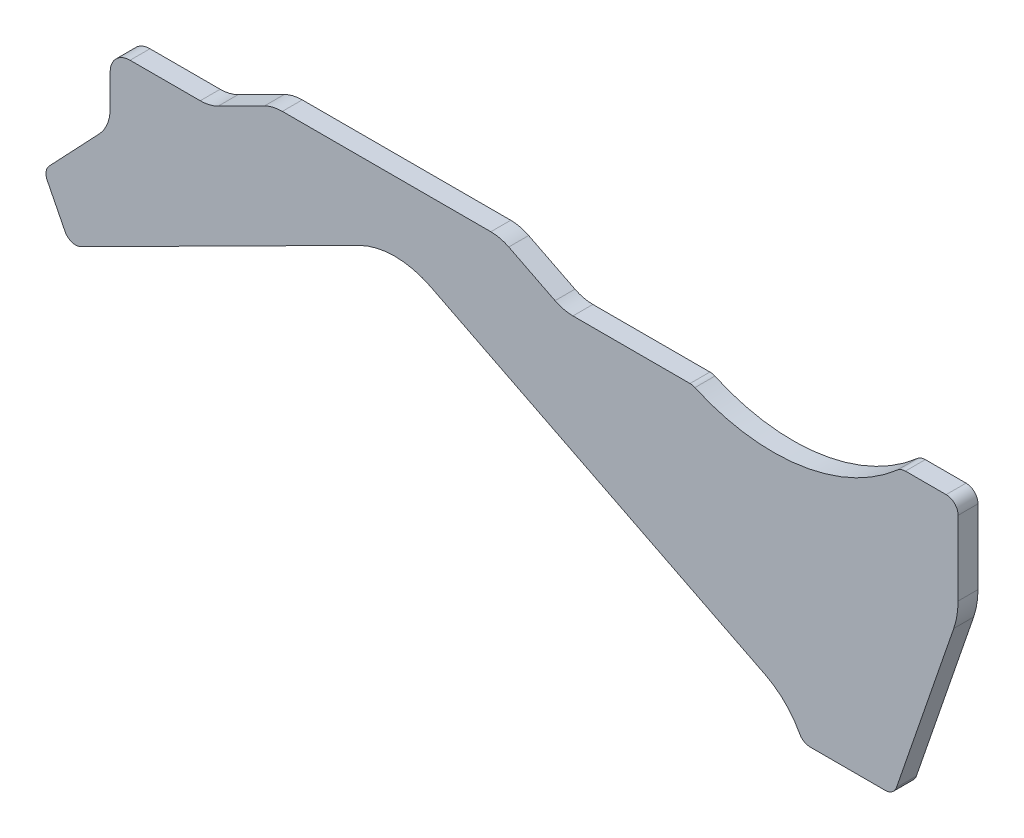
ISO-10303-21;
HEADER;
FILE_DESCRIPTION(('STEP AP214'),'2;1');
FILE_NAME('part.step','',(''),(''),'','','');
FILE_SCHEMA(('AUTOMOTIVE_DESIGN { 1 0 10303 214 1 1 1 1 }'));
ENDSEC;
DATA;
#1=APPLICATION_CONTEXT('core data for automotive mechanical design processes');
#2=APPLICATION_PROTOCOL_DEFINITION('international standard','automotive_design',2000,#1);
#3=PRODUCT_CONTEXT('',#1,'mechanical');
#4=PRODUCT('Part','Part','',(#3));
#5=PRODUCT_RELATED_PRODUCT_CATEGORY('part','',(#4));
#6=PRODUCT_DEFINITION_FORMATION('','',#4);
#7=PRODUCT_DEFINITION_CONTEXT('part definition',#1,'design');
#8=PRODUCT_DEFINITION('design','',#6,#7);
#9=PRODUCT_DEFINITION_SHAPE('','',#8);
#10=(LENGTH_UNIT() NAMED_UNIT(*) SI_UNIT(.MILLI.,.METRE.));
#11=(NAMED_UNIT(*) PLANE_ANGLE_UNIT() SI_UNIT($,.RADIAN.));
#12=(NAMED_UNIT(*) SI_UNIT($,.STERADIAN.) SOLID_ANGLE_UNIT());
#13=UNCERTAINTY_MEASURE_WITH_UNIT(LENGTH_MEASURE(1.E-05),#10,'distance_accuracy_value','');
#14=(GEOMETRIC_REPRESENTATION_CONTEXT(3) GLOBAL_UNCERTAINTY_ASSIGNED_CONTEXT((#13)) GLOBAL_UNIT_ASSIGNED_CONTEXT((#10,
#11,#12)) REPRESENTATION_CONTEXT('',''));
#15=CARTESIAN_POINT('',(0.,0.,0.));
#16=DIRECTION('',(0.,0.,1.));
#17=DIRECTION('',(1.,0.,0.));
#18=AXIS2_PLACEMENT_3D('',#15,#16,#17);
#19=CARTESIAN_POINT('',(-80.1713584928789,-37.0501496341165,5.));
#20=DIRECTION('',(0.,0.,-1.));
#21=DIRECTION('',(-1.,0.,0.));
#22=AXIS2_PLACEMENT_3D('',#19,#20,#21);
#23=CYLINDRICAL_SURFACE('',#22,3.00000000000001);
#24=CARTESIAN_POINT('',(-80.1713584928789,-37.0501496341165,0.));
#25=DIRECTION('',(0.,0.,1.));
#26=DIRECTION('',(-1.,0.,0.));
#27=AXIS2_PLACEMENT_3D('',#24,#25,#26);
#28=CIRCLE('',#27,3.00000000000001);
#29=CARTESIAN_POINT('',(-82.8502953231123,-38.4004449572289,0.));
#30=VERTEX_POINT('',#29);
#31=CARTESIAN_POINT('',(-78.8210631697666,-39.72908646435,0.));
#32=VERTEX_POINT('',#31);
#33=EDGE_CURVE('E273',#30,#32,#28,.T.);
#34=ORIENTED_EDGE('',*,*,#33,.T.);
#35=DIRECTION('',(0.,0.,-1.));
#36=VECTOR('',#35,1.);
#37=CARTESIAN_POINT('',(-78.8210631697666,-39.72908646435,5.));
#38=LINE('',#37,#36);
#39=CARTESIAN_POINT('',(-78.8210631697666,-39.72908646435,5.));
#40=VERTEX_POINT('',#39);
#41=EDGE_CURVE('E11',#40,#32,#38,.T.);
#42=ORIENTED_EDGE('',*,*,#41,.F.);
#43=CARTESIAN_POINT('',(-80.1713584928789,-37.0501496341165,5.));
#44=DIRECTION('',(0.,0.,1.));
#45=DIRECTION('',(-1.,0.,0.));
#46=AXIS2_PLACEMENT_3D('',#43,#44,#45);
#47=CIRCLE('',#46,3.00000000000001);
#48=CARTESIAN_POINT('',(-82.8502953231123,-38.4004449572289,5.));
#49=VERTEX_POINT('',#48);
#50=EDGE_CURVE('E333',#49,#40,#47,.T.);
#51=ORIENTED_EDGE('',*,*,#50,.F.);
#52=DIRECTION('',(0.,0.,-1.));
#53=VECTOR('',#52,1.);
#54=CARTESIAN_POINT('',(-82.8502953231123,-38.4004449572289,5.));
#55=LINE('',#54,#53);
#56=EDGE_CURVE('E269',#49,#30,#55,.T.);
#57=ORIENTED_EDGE('',*,*,#56,.T.);
#58=EDGE_LOOP('',(#34,#42,#51,#57));
#59=FACE_BOUND('',#58,.T.);
#60=ADVANCED_FACE('F39',(#59),#23,.T.);
#61=CARTESIAN_POINT('',(-9.00196882074865,-4.53736581627442,5.));
#62=DIRECTION('',(-0.450098441037433,0.892978943411138,0.));
#63=DIRECTION('',(-0.892978943411138,-0.450098441037433,0.));
#64=AXIS2_PLACEMENT_3D('',#61,#62,#63);
#65=PLANE('',#64);
#66=DIRECTION('',(0.892978943411138,0.450098441037433,0.));
#67=VECTOR('',#66,1.);
#68=CARTESIAN_POINT('',(-9.00196882074865,-4.53736581627442,0.));
#69=LINE('',#68,#67);
#70=CARTESIAN_POINT('',(-9.00196882074865,-4.53736581627442,0.));
#71=VERTEX_POINT('',#70);
#72=EDGE_CURVE('E276',#32,#71,#69,.T.);
#73=ORIENTED_EDGE('',*,*,#72,.T.);
#74=DIRECTION('',(0.,0.,-1.));
#75=VECTOR('',#74,1.);
#76=CARTESIAN_POINT('',(-9.00196882074865,-4.53736581627442,5.));
#77=LINE('',#76,#75);
#78=CARTESIAN_POINT('',(-9.00196882074865,-4.53736581627442,5.));
#79=VERTEX_POINT('',#78);
#80=EDGE_CURVE('E47',#79,#71,#77,.T.);
#81=ORIENTED_EDGE('',*,*,#80,.F.);
#82=DIRECTION('',(0.892978943411138,0.450098441037433,0.));
#83=VECTOR('',#82,1.);
#84=CARTESIAN_POINT('',(-9.00196882074865,-4.53736581627442,5.));
#85=LINE('',#84,#83);
#86=EDGE_CURVE('E167',#40,#79,#85,.T.);
#87=ORIENTED_EDGE('',*,*,#86,.F.);
#88=ORIENTED_EDGE('',*,*,#41,.T.);
#89=EDGE_LOOP('',(#73,#81,#87,#88));
#90=FACE_BOUND('',#89,.T.);
#91=ADVANCED_FACE('F506',(#90),#65,.F.);
#92=CARTESIAN_POINT('',(0.,-22.3969446844972,5.));
#93=DIRECTION('',(0.,0.,-1.));
#94=DIRECTION('',(-1.,0.,0.));
#95=AXIS2_PLACEMENT_3D('',#92,#93,#94);
#96=CYLINDRICAL_SURFACE('',#95,20.);
#97=CARTESIAN_POINT('',(0.,-22.3969446844972,0.));
#98=DIRECTION('',(0.,0.,-1.));
#99=DIRECTION('',(1.,0.,0.));
#100=AXIS2_PLACEMENT_3D('',#97,#98,#99);
#101=CIRCLE('',#100,20.);
#102=CARTESIAN_POINT('',(9.00196882074865,-4.53736581627441,0.));
#103=VERTEX_POINT('',#102);
#104=EDGE_CURVE('E278',#71,#103,#101,.T.);
#105=ORIENTED_EDGE('',*,*,#104,.T.);
#106=DIRECTION('',(0.,0.,-1.));
#107=VECTOR('',#106,1.);
#108=CARTESIAN_POINT('',(9.00196882074865,-4.53736581627441,5.));
#109=LINE('',#108,#107);
#110=CARTESIAN_POINT('',(9.00196882074865,-4.53736581627441,5.));
#111=VERTEX_POINT('',#110);
#112=EDGE_CURVE('E409',#111,#103,#109,.T.);
#113=ORIENTED_EDGE('',*,*,#112,.F.);
#114=CARTESIAN_POINT('',(0.,-22.3969446844972,5.));
#115=DIRECTION('',(0.,0.,-1.));
#116=DIRECTION('',(1.,0.,0.));
#117=AXIS2_PLACEMENT_3D('',#114,#115,#116);
#118=CIRCLE('',#117,20.);
#119=EDGE_CURVE('E417',#79,#111,#118,.T.);
#120=ORIENTED_EDGE('',*,*,#119,.F.);
#121=ORIENTED_EDGE('',*,*,#80,.T.);
#122=EDGE_LOOP('',(#105,#113,#120,#121));
#123=FACE_BOUND('',#122,.T.);
#124=ADVANCED_FACE('F415',(#123),#96,.F.);
#125=CARTESIAN_POINT('',(9.00196882074866,-4.5373658162744,5.));
#126=DIRECTION('',(0.450098441037432,0.892978943411139,0.));
#127=DIRECTION('',(-0.892978943411139,0.450098441037432,0.));
#128=AXIS2_PLACEMENT_3D('',#125,#126,#127);
#129=PLANE('',#128);
#130=DIRECTION('',(0.892978943411139,-0.450098441037432,0.));
#131=VECTOR('',#130,1.);
#132=CARTESIAN_POINT('',(9.00196882074866,-4.5373658162744,0.));
#133=LINE('',#132,#131);
#134=CARTESIAN_POINT('',(93.0019688207487,-46.8768513395482,0.));
#135=VERTEX_POINT('',#134);
#136=EDGE_CURVE('E280',#103,#135,#133,.T.);
#137=ORIENTED_EDGE('',*,*,#136,.T.);
#138=DIRECTION('',(0.,0.,-1.));
#139=VECTOR('',#138,1.);
#140=CARTESIAN_POINT('',(93.0019688207487,-46.8768513395482,5.));
#141=LINE('',#140,#139);
#142=CARTESIAN_POINT('',(93.0019688207487,-46.8768513395482,5.));
#143=VERTEX_POINT('',#142);
#144=EDGE_CURVE('E406',#143,#135,#141,.T.);
#145=ORIENTED_EDGE('',*,*,#144,.F.);
#146=DIRECTION('',(0.892978943411139,-0.450098441037432,0.));
#147=VECTOR('',#146,1.);
#148=CARTESIAN_POINT('',(9.00196882074866,-4.5373658162744,5.));
#149=LINE('',#148,#147);
#150=EDGE_CURVE('E435',#111,#143,#149,.T.);
#151=ORIENTED_EDGE('',*,*,#150,.F.);
#152=ORIENTED_EDGE('',*,*,#112,.T.);
#153=EDGE_LOOP('',(#137,#145,#151,#152));
#154=FACE_BOUND('',#153,.T.);
#155=ADVANCED_FACE('F426',(#154),#129,.F.);
#156=CARTESIAN_POINT('',(84.,-64.736430207771,5.));
#157=DIRECTION('',(0.,0.,-1.));
#158=DIRECTION('',(-1.,0.,0.));
#159=AXIS2_PLACEMENT_3D('',#156,#157,#158);
#160=CYLINDRICAL_SURFACE('',#159,20.);
#161=CARTESIAN_POINT('',(84.,-64.736430207771,0.));
#162=DIRECTION('',(0.,0.,-1.));
#163=DIRECTION('',(1.,0.,0.));
#164=AXIS2_PLACEMENT_3D('',#161,#162,#163);
#165=CIRCLE('',#164,20.);
#166=CARTESIAN_POINT('',(101.687244373564,-55.400403940144,0.));
#167=VERTEX_POINT('',#166);
#168=EDGE_CURVE('E282',#135,#167,#165,.T.);
#169=ORIENTED_EDGE('',*,*,#168,.T.);
#170=DIRECTION('',(0.,0.,-1.));
#171=VECTOR('',#170,1.);
#172=CARTESIAN_POINT('',(101.687244373564,-55.400403940144,5.));
#173=LINE('',#172,#171);
#174=CARTESIAN_POINT('',(101.687244373564,-55.400403940144,5.));
#175=VERTEX_POINT('',#174);
#176=EDGE_CURVE('E403',#175,#167,#173,.T.);
#177=ORIENTED_EDGE('',*,*,#176,.F.);
#178=CARTESIAN_POINT('',(84.,-64.736430207771,5.));
#179=DIRECTION('',(0.,0.,-1.));
#180=DIRECTION('',(1.,0.,0.));
#181=AXIS2_PLACEMENT_3D('',#178,#179,#180);
#182=CIRCLE('',#181,20.);
#183=EDGE_CURVE('E432',#143,#175,#182,.T.);
#184=ORIENTED_EDGE('',*,*,#183,.F.);
#185=ORIENTED_EDGE('',*,*,#144,.T.);
#186=EDGE_LOOP('',(#169,#177,#184,#185));
#187=FACE_BOUND('',#186,.T.);
#188=ADVANCED_FACE('F430',(#187),#160,.F.);
#189=CARTESIAN_POINT('',(104.340331029599,-54.,5.));
#190=DIRECTION('',(0.,0.,-1.));
#191=DIRECTION('',(-1.,0.,0.));
#192=AXIS2_PLACEMENT_3D('',#189,#190,#191);
#193=CYLINDRICAL_SURFACE('',#192,3.);
#194=CARTESIAN_POINT('',(104.340331029599,-54.,0.));
#195=DIRECTION('',(0.,0.,1.));
#196=DIRECTION('',(-1.,0.,0.));
#197=AXIS2_PLACEMENT_3D('',#194,#195,#196);
#198=CIRCLE('',#197,3.);
#199=CARTESIAN_POINT('',(104.340331029599,-57.,0.));
#200=VERTEX_POINT('',#199);
#201=EDGE_CURVE('E284',#167,#200,#198,.T.);
#202=ORIENTED_EDGE('',*,*,#201,.T.);
#203=DIRECTION('',(0.,0.,-1.));
#204=VECTOR('',#203,1.);
#205=CARTESIAN_POINT('',(104.340331029599,-57.,5.));
#206=LINE('',#205,#204);
#207=CARTESIAN_POINT('',(104.340331029599,-57.,5.));
#208=VERTEX_POINT('',#207);
#209=EDGE_CURVE('E400',#208,#200,#206,.T.);
#210=ORIENTED_EDGE('',*,*,#209,.F.);
#211=CARTESIAN_POINT('',(104.340331029599,-54.,5.));
#212=DIRECTION('',(0.,0.,1.));
#213=DIRECTION('',(-1.,0.,0.));
#214=AXIS2_PLACEMENT_3D('',#211,#212,#213);
#215=CIRCLE('',#214,3.);
#216=EDGE_CURVE('E434',#175,#208,#215,.T.);
#217=ORIENTED_EDGE('',*,*,#216,.F.);
#218=ORIENTED_EDGE('',*,*,#176,.T.);
#219=EDGE_LOOP('',(#202,#210,#217,#218));
#220=FACE_BOUND('',#219,.T.);
#221=ADVANCED_FACE('F519',(#220),#193,.T.);
#222=CARTESIAN_POINT('',(123.176722971695,-57.,5.));
#223=DIRECTION('',(0.,1.,0.));
#224=DIRECTION('',(-1.,0.,0.));
#225=AXIS2_PLACEMENT_3D('',#222,#223,#224);
#226=PLANE('',#225);
#227=DIRECTION('',(1.,0.,0.));
#228=VECTOR('',#227,1.);
#229=CARTESIAN_POINT('',(123.176722971695,-57.,0.));
#230=LINE('',#229,#228);
#231=CARTESIAN_POINT('',(123.176722971695,-57.,0.));
#232=VERTEX_POINT('',#231);
#233=EDGE_CURVE('E286',#200,#232,#230,.T.);
#234=ORIENTED_EDGE('',*,*,#233,.T.);
#235=DIRECTION('',(0.,0.,-1.));
#236=VECTOR('',#235,1.);
#237=CARTESIAN_POINT('',(123.176722971695,-57.,5.));
#238=LINE('',#237,#236);
#239=CARTESIAN_POINT('',(123.176722971695,-57.,5.));
#240=VERTEX_POINT('',#239);
#241=EDGE_CURVE('E397',#240,#232,#238,.T.);
#242=ORIENTED_EDGE('',*,*,#241,.F.);
#243=DIRECTION('',(1.,0.,0.));
#244=VECTOR('',#243,1.);
#245=CARTESIAN_POINT('',(123.176722971695,-57.,5.));
#246=LINE('',#245,#244);
#247=EDGE_CURVE('E437',#208,#240,#246,.T.);
#248=ORIENTED_EDGE('',*,*,#247,.F.);
#249=ORIENTED_EDGE('',*,*,#209,.T.);
#250=EDGE_LOOP('',(#234,#242,#248,#249));
#251=FACE_BOUND('',#250,.T.);
#252=ADVANCED_FACE('F522',(#251),#226,.F.);
#253=CARTESIAN_POINT('',(123.176722971695,-54.,5.));
#254=DIRECTION('',(0.,0.,-1.));
#255=DIRECTION('',(-1.,0.,0.));
#256=AXIS2_PLACEMENT_3D('',#253,#254,#255);
#257=CYLINDRICAL_SURFACE('',#256,3.);
#258=CARTESIAN_POINT('',(123.176722971695,-54.,0.));
#259=DIRECTION('',(0.,0.,1.));
#260=DIRECTION('',(1.,0.,0.));
#261=AXIS2_PLACEMENT_3D('',#258,#259,#260);
#262=CIRCLE('',#261,3.);
#263=CARTESIAN_POINT('',(126.013278698493,-54.9767044633714,0.));
#264=VERTEX_POINT('',#263);
#265=EDGE_CURVE('E288',#232,#264,#262,.T.);
#266=ORIENTED_EDGE('',*,*,#265,.T.);
#267=DIRECTION('',(0.,0.,-1.));
#268=VECTOR('',#267,1.);
#269=CARTESIAN_POINT('',(126.013278698493,-54.9767044633714,5.));
#270=LINE('',#269,#268);
#271=CARTESIAN_POINT('',(126.013278698493,-54.9767044633714,5.));
#272=VERTEX_POINT('',#271);
#273=EDGE_CURVE('E394',#272,#264,#270,.T.);
#274=ORIENTED_EDGE('',*,*,#273,.F.);
#275=CARTESIAN_POINT('',(123.176722971695,-54.,5.));
#276=DIRECTION('',(0.,0.,1.));
#277=DIRECTION('',(1.,0.,0.));
#278=AXIS2_PLACEMENT_3D('',#275,#276,#277);
#279=CIRCLE('',#278,3.);
#280=EDGE_CURVE('E443',#240,#272,#279,.T.);
#281=ORIENTED_EDGE('',*,*,#280,.F.);
#282=ORIENTED_EDGE('',*,*,#241,.T.);
#283=EDGE_LOOP('',(#266,#274,#281,#282));
#284=FACE_BOUND('',#283,.T.);
#285=ADVANCED_FACE('F526',(#284),#257,.T.);
#286=CARTESIAN_POINT('',(126.013278698493,-54.9767044633714,5.));
#287=DIRECTION('',(-0.945518575599317,0.325568154457157,0.));
#288=DIRECTION('',(-0.325568154457157,-0.945518575599317,0.));
#289=AXIS2_PLACEMENT_3D('',#286,#287,#288);
#290=PLANE('',#289);
#291=DIRECTION('',(0.325568154457157,0.945518575599317,0.));
#292=VECTOR('',#291,1.);
#293=CARTESIAN_POINT('',(126.013278698493,-54.9767044633714,0.));
#294=LINE('',#293,#292);
#295=CARTESIAN_POINT('',(140.410371511986,-13.1645109075147,0.));
#296=VERTEX_POINT('',#295);
#297=EDGE_CURVE('E290',#264,#296,#294,.T.);
#298=ORIENTED_EDGE('',*,*,#297,.T.);
#299=DIRECTION('',(0.,0.,-1.));
#300=VECTOR('',#299,1.);
#301=CARTESIAN_POINT('',(140.410371511986,-13.1645109075147,5.));
#302=LINE('',#301,#300);
#303=CARTESIAN_POINT('',(140.410371511986,-13.1645109075147,5.));
#304=VERTEX_POINT('',#303);
#305=EDGE_CURVE('E391',#304,#296,#302,.T.);
#306=ORIENTED_EDGE('',*,*,#305,.F.);
#307=DIRECTION('',(0.325568154457157,0.945518575599317,0.));
#308=VECTOR('',#307,1.);
#309=CARTESIAN_POINT('',(126.013278698493,-54.9767044633714,5.));
#310=LINE('',#309,#308);
#311=EDGE_CURVE('E445',#272,#304,#310,.T.);
#312=ORIENTED_EDGE('',*,*,#311,.F.);
#313=ORIENTED_EDGE('',*,*,#273,.T.);
#314=EDGE_LOOP('',(#298,#306,#312,#313));
#315=FACE_BOUND('',#314,.T.);
#316=ADVANCED_FACE('F530',(#315),#290,.F.);
#317=CARTESIAN_POINT('',(121.5,-6.65314781837158,5.));
#318=DIRECTION('',(0.,0.,-1.));
#319=DIRECTION('',(-1.,0.,0.));
#320=AXIS2_PLACEMENT_3D('',#317,#318,#319);
#321=CYLINDRICAL_SURFACE('',#320,20.);
#322=CARTESIAN_POINT('',(121.5,-6.65314781837158,0.));
#323=DIRECTION('',(0.,0.,1.));
#324=DIRECTION('',(1.,0.,0.));
#325=AXIS2_PLACEMENT_3D('',#322,#323,#324);
#326=CIRCLE('',#325,20.);
#327=CARTESIAN_POINT('',(141.5,-6.65314781837158,0.));
#328=VERTEX_POINT('',#327);
#329=EDGE_CURVE('E292',#296,#328,#326,.T.);
#330=ORIENTED_EDGE('',*,*,#329,.T.);
#331=DIRECTION('',(0.,0.,-1.));
#332=VECTOR('',#331,1.);
#333=CARTESIAN_POINT('',(141.5,-6.65314781837158,5.));
#334=LINE('',#333,#332);
#335=CARTESIAN_POINT('',(141.5,-6.65314781837158,5.));
#336=VERTEX_POINT('',#335);
#337=EDGE_CURVE('E388',#336,#328,#334,.T.);
#338=ORIENTED_EDGE('',*,*,#337,.F.);
#339=CARTESIAN_POINT('',(121.5,-6.65314781837158,5.));
#340=DIRECTION('',(0.,0.,1.));
#341=DIRECTION('',(1.,0.,0.));
#342=AXIS2_PLACEMENT_3D('',#339,#340,#341);
#343=CIRCLE('',#342,20.);
#344=EDGE_CURVE('E447',#304,#336,#343,.T.);
#345=ORIENTED_EDGE('',*,*,#344,.F.);
#346=ORIENTED_EDGE('',*,*,#305,.T.);
#347=EDGE_LOOP('',(#330,#338,#345,#346));
#348=FACE_BOUND('',#347,.T.);
#349=ADVANCED_FACE('F534',(#348),#321,.T.);
#350=CARTESIAN_POINT('',(141.5,-6.65314781837158,5.));
#351=DIRECTION('',(-1.,0.,0.));
#352=DIRECTION('',(0.,-1.,0.));
#353=AXIS2_PLACEMENT_3D('',#350,#351,#352);
#354=PLANE('',#353);
#355=DIRECTION('',(0.,1.,0.));
#356=VECTOR('',#355,1.);
#357=CARTESIAN_POINT('',(141.5,-6.65314781837158,0.));
#358=LINE('',#357,#356);
#359=CARTESIAN_POINT('',(141.5,12.,0.));
#360=VERTEX_POINT('',#359);
#361=EDGE_CURVE('E294',#328,#360,#358,.T.);
#362=ORIENTED_EDGE('',*,*,#361,.T.);
#363=DIRECTION('',(0.,0.,-1.));
#364=VECTOR('',#363,1.);
#365=CARTESIAN_POINT('',(141.5,12.,5.));
#366=LINE('',#365,#364);
#367=CARTESIAN_POINT('',(141.5,12.,5.));
#368=VERTEX_POINT('',#367);
#369=EDGE_CURVE('E385',#368,#360,#366,.T.);
#370=ORIENTED_EDGE('',*,*,#369,.F.);
#371=DIRECTION('',(0.,1.,0.));
#372=VECTOR('',#371,1.);
#373=CARTESIAN_POINT('',(141.5,-6.65314781837158,5.));
#374=LINE('',#373,#372);
#375=EDGE_CURVE('E449',#336,#368,#374,.T.);
#376=ORIENTED_EDGE('',*,*,#375,.F.);
#377=ORIENTED_EDGE('',*,*,#337,.T.);
#378=EDGE_LOOP('',(#362,#370,#376,#377));
#379=FACE_BOUND('',#378,.T.);
#380=ADVANCED_FACE('F538',(#379),#354,.F.);
#381=CARTESIAN_POINT('',(138.5,12.,5.));
#382=DIRECTION('',(0.,0.,-1.));
#383=DIRECTION('',(-1.,0.,0.));
#384=AXIS2_PLACEMENT_3D('',#381,#382,#383);
#385=CYLINDRICAL_SURFACE('',#384,3.);
#386=CARTESIAN_POINT('',(138.5,12.,0.));
#387=DIRECTION('',(0.,0.,1.));
#388=DIRECTION('',(1.,0.,0.));
#389=AXIS2_PLACEMENT_3D('',#386,#387,#388);
#390=CIRCLE('',#389,3.);
#391=CARTESIAN_POINT('',(138.5,15.,0.));
#392=VERTEX_POINT('',#391);
#393=EDGE_CURVE('E296',#360,#392,#390,.T.);
#394=ORIENTED_EDGE('',*,*,#393,.T.);
#395=DIRECTION('',(0.,0.,-1.));
#396=VECTOR('',#395,1.);
#397=CARTESIAN_POINT('',(138.5,15.,5.));
#398=LINE('',#397,#396);
#399=CARTESIAN_POINT('',(138.5,15.,5.));
#400=VERTEX_POINT('',#399);
#401=EDGE_CURVE('E382',#400,#392,#398,.T.);
#402=ORIENTED_EDGE('',*,*,#401,.F.);
#403=CARTESIAN_POINT('',(138.5,12.,5.));
#404=DIRECTION('',(0.,0.,1.));
#405=DIRECTION('',(1.,0.,0.));
#406=AXIS2_PLACEMENT_3D('',#403,#404,#405);
#407=CIRCLE('',#406,3.);
#408=EDGE_CURVE('E451',#368,#400,#407,.T.);
#409=ORIENTED_EDGE('',*,*,#408,.F.);
#410=ORIENTED_EDGE('',*,*,#369,.T.);
#411=EDGE_LOOP('',(#394,#402,#409,#410));
#412=FACE_BOUND('',#411,.T.);
#413=ADVANCED_FACE('F542',(#412),#385,.T.);
#414=CARTESIAN_POINT('',(138.5,15.,5.));
#415=DIRECTION('',(0.,-1.,0.));
#416=DIRECTION('',(0.,0.,-1.));
#417=AXIS2_PLACEMENT_3D('',#414,#415,#416);
#418=PLANE('',#417);
#419=DIRECTION('',(-1.,0.,0.));
#420=VECTOR('',#419,1.);
#421=CARTESIAN_POINT('',(138.5,15.,0.));
#422=LINE('',#421,#420);
#423=CARTESIAN_POINT('',(128.260336739125,15.,0.));
#424=VERTEX_POINT('',#423);
#425=EDGE_CURVE('E298',#392,#424,#422,.T.);
#426=ORIENTED_EDGE('',*,*,#425,.T.);
#427=DIRECTION('',(0.,0.,-1.));
#428=VECTOR('',#427,1.);
#429=CARTESIAN_POINT('',(128.260336739125,15.,5.));
#430=LINE('',#429,#428);
#431=CARTESIAN_POINT('',(128.260336739125,15.,5.));
#432=VERTEX_POINT('',#431);
#433=EDGE_CURVE('E379',#432,#424,#430,.T.);
#434=ORIENTED_EDGE('',*,*,#433,.F.);
#435=DIRECTION('',(-1.,0.,0.));
#436=VECTOR('',#435,1.);
#437=CARTESIAN_POINT('',(138.5,15.,5.));
#438=LINE('',#437,#436);
#439=EDGE_CURVE('E453',#400,#432,#438,.T.);
#440=ORIENTED_EDGE('',*,*,#439,.F.);
#441=ORIENTED_EDGE('',*,*,#401,.T.);
#442=EDGE_LOOP('',(#426,#434,#440,#441));
#443=FACE_BOUND('',#442,.T.);
#444=ADVANCED_FACE('F546',(#443),#418,.F.);
#445=CARTESIAN_POINT('',(128.260336739125,12.,5.));
#446=DIRECTION('',(0.,0.,-1.));
#447=DIRECTION('',(-1.,0.,0.));
#448=AXIS2_PLACEMENT_3D('',#445,#446,#447);
#449=CYLINDRICAL_SURFACE('',#448,3.);
#450=CARTESIAN_POINT('',(128.260336739125,12.,0.));
#451=DIRECTION('',(0.,0.,1.));
#452=DIRECTION('',(1.,0.,0.));
#453=AXIS2_PLACEMENT_3D('',#450,#451,#452);
#454=CIRCLE('',#453,3.);
#455=CARTESIAN_POINT('',(126.284475150662,14.2574257425743,0.));
#456=VERTEX_POINT('',#455);
#457=EDGE_CURVE('E300',#424,#456,#454,.T.);
#458=ORIENTED_EDGE('',*,*,#457,.T.);
#459=DIRECTION('',(0.,0.,-1.));
#460=VECTOR('',#459,1.);
#461=CARTESIAN_POINT('',(126.284475150662,14.2574257425743,5.));
#462=LINE('',#461,#460);
#463=CARTESIAN_POINT('',(126.284475150662,14.2574257425743,5.));
#464=VERTEX_POINT('',#463);
#465=EDGE_CURVE('E376',#464,#456,#462,.T.);
#466=ORIENTED_EDGE('',*,*,#465,.F.);
#467=CARTESIAN_POINT('',(128.260336739125,12.,5.));
#468=DIRECTION('',(0.,0.,1.));
#469=DIRECTION('',(1.,0.,0.));
#470=AXIS2_PLACEMENT_3D('',#467,#468,#469);
#471=CIRCLE('',#470,3.);
#472=EDGE_CURVE('E455',#432,#464,#471,.T.);
#473=ORIENTED_EDGE('',*,*,#472,.F.);
#474=ORIENTED_EDGE('',*,*,#433,.T.);
#475=EDGE_LOOP('',(#458,#466,#473,#474));
#476=FACE_BOUND('',#475,.T.);
#477=ADVANCED_FACE('F550',(#476),#449,.T.);
#478=CARTESIAN_POINT('',(95.,50.,5.));
#479=DIRECTION('',(0.,0.,-1.));
#480=DIRECTION('',(-1.,0.,0.));
#481=AXIS2_PLACEMENT_3D('',#478,#479,#480);
#482=CYLINDRICAL_SURFACE('',#481,47.5);
#483=CARTESIAN_POINT('',(95.,50.,0.));
#484=DIRECTION('',(0.,0.,-1.));
#485=DIRECTION('',(1.,0.,0.));
#486=AXIS2_PLACEMENT_3D('',#483,#484,#485);
#487=CIRCLE('',#486,47.5);
#488=CARTESIAN_POINT('',(75.3992745693406,6.73267326732677,0.));
#489=VERTEX_POINT('',#488);
#490=EDGE_CURVE('E302',#456,#489,#487,.T.);
#491=ORIENTED_EDGE('',*,*,#490,.T.);
#492=DIRECTION('',(0.,0.,-1.));
#493=VECTOR('',#492,1.);
#494=CARTESIAN_POINT('',(75.3992745693406,6.73267326732677,5.));
#495=LINE('',#494,#493);
#496=CARTESIAN_POINT('',(75.3992745693406,6.73267326732677,5.));
#497=VERTEX_POINT('',#496);
#498=EDGE_CURVE('E373',#497,#489,#495,.T.);
#499=ORIENTED_EDGE('',*,*,#498,.F.);
#500=CARTESIAN_POINT('',(95.,50.,5.));
#501=DIRECTION('',(0.,0.,-1.));
#502=DIRECTION('',(1.,0.,0.));
#503=AXIS2_PLACEMENT_3D('',#500,#501,#502);
#504=CIRCLE('',#503,47.5);
#505=EDGE_CURVE('E457',#464,#497,#504,.T.);
#506=ORIENTED_EDGE('',*,*,#505,.F.);
#507=ORIENTED_EDGE('',*,*,#465,.T.);
#508=EDGE_LOOP('',(#491,#499,#506,#507));
#509=FACE_BOUND('',#508,.T.);
#510=ADVANCED_FACE('F554',(#509),#482,.F.);
#511=CARTESIAN_POINT('',(74.1613340158252,4.00000000000003,5.));
#512=DIRECTION('',(0.,0.,-1.));
#513=DIRECTION('',(-1.,0.,0.));
#514=AXIS2_PLACEMENT_3D('',#511,#512,#513);
#515=CYLINDRICAL_SURFACE('',#514,3.);
#516=CARTESIAN_POINT('',(74.1613340158252,4.00000000000003,0.));
#517=DIRECTION('',(0.,0.,1.));
#518=DIRECTION('',(1.,0.,0.));
#519=AXIS2_PLACEMENT_3D('',#516,#517,#518);
#520=CIRCLE('',#519,3.);
#521=CARTESIAN_POINT('',(74.1613340158252,7.00000000000002,0.));
#522=VERTEX_POINT('',#521);
#523=EDGE_CURVE('E304',#489,#522,#520,.T.);
#524=ORIENTED_EDGE('',*,*,#523,.T.);
#525=DIRECTION('',(0.,0.,-1.));
#526=VECTOR('',#525,1.);
#527=CARTESIAN_POINT('',(74.1613340158252,7.00000000000002,5.));
#528=LINE('',#527,#526);
#529=CARTESIAN_POINT('',(74.1613340158252,7.00000000000002,5.));
#530=VERTEX_POINT('',#529);
#531=EDGE_CURVE('E370',#530,#522,#528,.T.);
#532=ORIENTED_EDGE('',*,*,#531,.F.);
#533=CARTESIAN_POINT('',(74.1613340158252,4.00000000000003,5.));
#534=DIRECTION('',(0.,0.,1.));
#535=DIRECTION('',(1.,0.,0.));
#536=AXIS2_PLACEMENT_3D('',#533,#534,#535);
#537=CIRCLE('',#536,3.);
#538=EDGE_CURVE('E459',#497,#530,#537,.T.);
#539=ORIENTED_EDGE('',*,*,#538,.F.);
#540=ORIENTED_EDGE('',*,*,#498,.T.);
#541=EDGE_LOOP('',(#524,#532,#539,#540));
#542=FACE_BOUND('',#541,.T.);
#543=ADVANCED_FACE('F558',(#542),#515,.T.);
#544=CARTESIAN_POINT('',(44.7494347108716,7.00000000000002,5.));
#545=DIRECTION('',(0.,-1.,0.));
#546=DIRECTION('',(1.,0.,0.));
#547=AXIS2_PLACEMENT_3D('',#544,#545,#546);
#548=PLANE('',#547);
#549=DIRECTION('',(-1.,0.,0.));
#550=VECTOR('',#549,1.);
#551=CARTESIAN_POINT('',(44.7494347108716,7.00000000000002,0.));
#552=LINE('',#551,#550);
#553=CARTESIAN_POINT('',(44.7494347108716,7.00000000000002,0.));
#554=VERTEX_POINT('',#553);
#555=EDGE_CURVE('E306',#522,#554,#552,.T.);
#556=ORIENTED_EDGE('',*,*,#555,.T.);
#557=DIRECTION('',(0.,0.,-1.));
#558=VECTOR('',#557,1.);
#559=CARTESIAN_POINT('',(44.7494347108716,7.00000000000002,5.));
#560=LINE('',#559,#558);
#561=CARTESIAN_POINT('',(44.7494347108716,7.00000000000002,5.));
#562=VERTEX_POINT('',#561);
#563=EDGE_CURVE('E367',#562,#554,#560,.T.);
#564=ORIENTED_EDGE('',*,*,#563,.F.);
#565=DIRECTION('',(-1.,0.,0.));
#566=VECTOR('',#565,1.);
#567=CARTESIAN_POINT('',(44.7494347108716,7.00000000000002,5.));
#568=LINE('',#567,#566);
#569=EDGE_CURVE('E461',#530,#562,#568,.T.);
#570=ORIENTED_EDGE('',*,*,#569,.F.);
#571=ORIENTED_EDGE('',*,*,#531,.T.);
#572=EDGE_LOOP('',(#556,#564,#570,#571));
#573=FACE_BOUND('',#572,.T.);
#574=ADVANCED_FACE('F562',(#573),#548,.F.);
#575=CARTESIAN_POINT('',(44.7494347108716,17.,5.));
#576=DIRECTION('',(0.,0.,-1.));
#577=DIRECTION('',(-1.,0.,0.));
#578=AXIS2_PLACEMENT_3D('',#575,#576,#577);
#579=CYLINDRICAL_SURFACE('',#578,10.);
#580=CARTESIAN_POINT('',(44.7494347108716,17.,0.));
#581=DIRECTION('',(0.,0.,-1.));
#582=DIRECTION('',(-1.,0.,0.));
#583=AXIS2_PLACEMENT_3D('',#580,#581,#582);
#584=CIRCLE('',#583,10.);
#585=CARTESIAN_POINT('',(40.2484503004973,8.07021056588863,0.));
#586=VERTEX_POINT('',#585);
#587=EDGE_CURVE('E308',#554,#586,#584,.T.);
#588=ORIENTED_EDGE('',*,*,#587,.T.);
#589=DIRECTION('',(0.,0.,-1.));
#590=VECTOR('',#589,1.);
#591=CARTESIAN_POINT('',(40.2484503004973,8.07021056588863,5.));
#592=LINE('',#591,#590);
#593=CARTESIAN_POINT('',(40.2484503004973,8.07021056588863,5.));
#594=VERTEX_POINT('',#593);
#595=EDGE_CURVE('E364',#594,#586,#592,.T.);
#596=ORIENTED_EDGE('',*,*,#595,.F.);
#597=CARTESIAN_POINT('',(44.7494347108716,17.,5.));
#598=DIRECTION('',(0.,0.,-1.));
#599=DIRECTION('',(-1.,0.,0.));
#600=AXIS2_PLACEMENT_3D('',#597,#598,#599);
#601=CIRCLE('',#600,10.);
#602=EDGE_CURVE('E463',#562,#594,#601,.T.);
#603=ORIENTED_EDGE('',*,*,#602,.F.);
#604=ORIENTED_EDGE('',*,*,#563,.T.);
#605=EDGE_LOOP('',(#588,#596,#603,#604));
#606=FACE_BOUND('',#605,.T.);
#607=ADVANCED_FACE('F566',(#606),#579,.F.);
#608=CARTESIAN_POINT('',(40.2484503004973,8.07021056588863,5.));
#609=DIRECTION('',(-0.450098441037432,-0.892978943411139,0.));
#610=DIRECTION('',(0.892978943411139,-0.450098441037432,0.));
#611=AXIS2_PLACEMENT_3D('',#608,#609,#610);
#612=PLANE('',#611);
#613=DIRECTION('',(-0.892978943411138,0.450098441037432,0.));
#614=VECTOR('',#613,1.);
#615=CARTESIAN_POINT('',(40.2484503004973,8.07021056588863,0.));
#616=LINE('',#615,#614);
#617=CARTESIAN_POINT('',(28.6232588545561,13.9297894341114,0.));
#618=VERTEX_POINT('',#617);
#619=EDGE_CURVE('E310',#586,#618,#616,.T.);
#620=ORIENTED_EDGE('',*,*,#619,.T.);
#621=DIRECTION('',(0.,0.,-1.));
#622=VECTOR('',#621,1.);
#623=CARTESIAN_POINT('',(28.6232588545561,13.9297894341114,5.));
#624=LINE('',#623,#622);
#625=CARTESIAN_POINT('',(28.6232588545561,13.9297894341114,5.));
#626=VERTEX_POINT('',#625);
#627=EDGE_CURVE('E361',#626,#618,#624,.T.);
#628=ORIENTED_EDGE('',*,*,#627,.F.);
#629=DIRECTION('',(-0.892978943411138,0.450098441037432,0.));
#630=VECTOR('',#629,1.);
#631=CARTESIAN_POINT('',(40.2484503004973,8.07021056588863,5.));
#632=LINE('',#631,#630);
#633=EDGE_CURVE('E465',#594,#626,#632,.T.);
#634=ORIENTED_EDGE('',*,*,#633,.F.);
#635=ORIENTED_EDGE('',*,*,#595,.T.);
#636=EDGE_LOOP('',(#620,#628,#634,#635));
#637=FACE_BOUND('',#636,.T.);
#638=ADVANCED_FACE('F570',(#637),#612,.F.);
#639=CARTESIAN_POINT('',(24.1222744441818,5.00000000000001,5.));
#640=DIRECTION('',(0.,0.,-1.));
#641=DIRECTION('',(-1.,0.,0.));
#642=AXIS2_PLACEMENT_3D('',#639,#640,#641);
#643=CYLINDRICAL_SURFACE('',#642,10.);
#644=CARTESIAN_POINT('',(24.1222744441818,5.00000000000001,0.));
#645=DIRECTION('',(0.,0.,1.));
#646=DIRECTION('',(1.,0.,0.));
#647=AXIS2_PLACEMENT_3D('',#644,#645,#646);
#648=CIRCLE('',#647,10.);
#649=CARTESIAN_POINT('',(24.1222744441818,15.,0.));
#650=VERTEX_POINT('',#649);
#651=EDGE_CURVE('E312',#618,#650,#648,.T.);
#652=ORIENTED_EDGE('',*,*,#651,.T.);
#653=DIRECTION('',(0.,0.,-1.));
#654=VECTOR('',#653,1.);
#655=CARTESIAN_POINT('',(24.1222744441818,15.,5.));
#656=LINE('',#655,#654);
#657=CARTESIAN_POINT('',(24.1222744441818,15.,5.));
#658=VERTEX_POINT('',#657);
#659=EDGE_CURVE('E358',#658,#650,#656,.T.);
#660=ORIENTED_EDGE('',*,*,#659,.F.);
#661=CARTESIAN_POINT('',(24.1222744441818,5.00000000000001,5.));
#662=DIRECTION('',(0.,0.,1.));
#663=DIRECTION('',(1.,0.,0.));
#664=AXIS2_PLACEMENT_3D('',#661,#662,#663);
#665=CIRCLE('',#664,10.);
#666=EDGE_CURVE('E467',#626,#658,#665,.T.);
#667=ORIENTED_EDGE('',*,*,#666,.F.);
#668=ORIENTED_EDGE('',*,*,#627,.T.);
#669=EDGE_LOOP('',(#652,#660,#667,#668));
#670=FACE_BOUND('',#669,.T.);
#671=ADVANCED_FACE('F574',(#670),#643,.T.);
#672=CARTESIAN_POINT('',(-28.2505652891284,15.,5.));
#673=DIRECTION('',(0.,-1.,0.));
#674=DIRECTION('',(1.,0.,0.));
#675=AXIS2_PLACEMENT_3D('',#672,#673,#674);
#676=PLANE('',#675);
#677=DIRECTION('',(-1.,0.,0.));
#678=VECTOR('',#677,1.);
#679=CARTESIAN_POINT('',(-28.2505652891284,15.,0.));
#680=LINE('',#679,#678);
#681=CARTESIAN_POINT('',(-28.2505652891284,15.,0.));
#682=VERTEX_POINT('',#681);
#683=EDGE_CURVE('E314',#650,#682,#680,.T.);
#684=ORIENTED_EDGE('',*,*,#683,.T.);
#685=DIRECTION('',(0.,0.,-1.));
#686=VECTOR('',#685,1.);
#687=CARTESIAN_POINT('',(-28.2505652891284,15.,5.));
#688=LINE('',#687,#686);
#689=CARTESIAN_POINT('',(-28.2505652891284,15.,5.));
#690=VERTEX_POINT('',#689);
#691=EDGE_CURVE('E355',#690,#682,#688,.T.);
#692=ORIENTED_EDGE('',*,*,#691,.F.);
#693=DIRECTION('',(-1.,0.,0.));
#694=VECTOR('',#693,1.);
#695=CARTESIAN_POINT('',(-28.2505652891284,15.,5.));
#696=LINE('',#695,#694);
#697=EDGE_CURVE('E469',#658,#690,#696,.T.);
#698=ORIENTED_EDGE('',*,*,#697,.F.);
#699=ORIENTED_EDGE('',*,*,#659,.T.);
#700=EDGE_LOOP('',(#684,#692,#698,#699));
#701=FACE_BOUND('',#700,.T.);
#702=ADVANCED_FACE('F578',(#701),#676,.F.);
#703=CARTESIAN_POINT('',(-28.2505652891284,4.99999999999999,5.));
#704=DIRECTION('',(0.,0.,-1.));
#705=DIRECTION('',(-1.,0.,0.));
#706=AXIS2_PLACEMENT_3D('',#703,#704,#705);
#707=CYLINDRICAL_SURFACE('',#706,9.99999999999999);
#708=CARTESIAN_POINT('',(-28.2505652891284,4.99999999999999,0.));
#709=DIRECTION('',(0.,0.,1.));
#710=DIRECTION('',(-1.,0.,0.));
#711=AXIS2_PLACEMENT_3D('',#708,#709,#710);
#712=CIRCLE('',#711,9.99999999999999);
#713=CARTESIAN_POINT('',(-32.7515496995027,13.9297894341114,0.));
#714=VERTEX_POINT('',#713);
#715=EDGE_CURVE('E316',#682,#714,#712,.T.);
#716=ORIENTED_EDGE('',*,*,#715,.T.);
#717=DIRECTION('',(0.,0.,-1.));
#718=VECTOR('',#717,1.);
#719=CARTESIAN_POINT('',(-32.7515496995027,13.9297894341114,5.));
#720=LINE('',#719,#718);
#721=CARTESIAN_POINT('',(-32.7515496995027,13.9297894341114,5.));
#722=VERTEX_POINT('',#721);
#723=EDGE_CURVE('E352',#722,#714,#720,.T.);
#724=ORIENTED_EDGE('',*,*,#723,.F.);
#725=CARTESIAN_POINT('',(-28.2505652891284,4.99999999999999,5.));
#726=DIRECTION('',(0.,0.,1.));
#727=DIRECTION('',(-1.,0.,0.));
#728=AXIS2_PLACEMENT_3D('',#725,#726,#727);
#729=CIRCLE('',#728,9.99999999999999);
#730=EDGE_CURVE('E471',#690,#722,#729,.T.);
#731=ORIENTED_EDGE('',*,*,#730,.F.);
#732=ORIENTED_EDGE('',*,*,#691,.T.);
#733=EDGE_LOOP('',(#716,#724,#731,#732));
#734=FACE_BOUND('',#733,.T.);
#735=ADVANCED_FACE('F582',(#734),#707,.T.);
#736=CARTESIAN_POINT('',(-32.7515496995027,13.9297894341114,5.));
#737=DIRECTION('',(0.450098441037434,-0.892978943411138,0.));
#738=DIRECTION('',(0.892978943411138,0.450098441037434,0.));
#739=AXIS2_PLACEMENT_3D('',#736,#737,#738);
#740=PLANE('',#739);
#741=DIRECTION('',(-0.892978943411138,-0.450098441037434,0.));
#742=VECTOR('',#741,1.);
#743=CARTESIAN_POINT('',(-32.7515496995027,13.9297894341114,0.));
#744=LINE('',#743,#742);
#745=CARTESIAN_POINT('',(-44.3767411454438,8.0702105658886,0.));
#746=VERTEX_POINT('',#745);
#747=EDGE_CURVE('E318',#714,#746,#744,.T.);
#748=ORIENTED_EDGE('',*,*,#747,.T.);
#749=DIRECTION('',(0.,0.,-1.));
#750=VECTOR('',#749,1.);
#751=CARTESIAN_POINT('',(-44.3767411454438,8.0702105658886,5.));
#752=LINE('',#751,#750);
#753=CARTESIAN_POINT('',(-44.3767411454438,8.0702105658886,5.));
#754=VERTEX_POINT('',#753);
#755=EDGE_CURVE('E349',#754,#746,#752,.T.);
#756=ORIENTED_EDGE('',*,*,#755,.F.);
#757=DIRECTION('',(-0.892978943411138,-0.450098441037434,0.));
#758=VECTOR('',#757,1.);
#759=CARTESIAN_POINT('',(-32.7515496995027,13.9297894341114,5.));
#760=LINE('',#759,#758);
#761=EDGE_CURVE('E473',#722,#754,#760,.T.);
#762=ORIENTED_EDGE('',*,*,#761,.F.);
#763=ORIENTED_EDGE('',*,*,#723,.T.);
#764=EDGE_LOOP('',(#748,#756,#762,#763));
#765=FACE_BOUND('',#764,.T.);
#766=ADVANCED_FACE('F586',(#765),#740,.F.);
#767=CARTESIAN_POINT('',(-48.8777255558182,17.,5.));
#768=DIRECTION('',(0.,0.,-1.));
#769=DIRECTION('',(-1.,0.,0.));
#770=AXIS2_PLACEMENT_3D('',#767,#768,#769);
#771=CYLINDRICAL_SURFACE('',#770,10.);
#772=CARTESIAN_POINT('',(-48.8777255558182,17.,0.));
#773=DIRECTION('',(0.,0.,-1.));
#774=DIRECTION('',(-1.,0.,0.));
#775=AXIS2_PLACEMENT_3D('',#772,#773,#774);
#776=CIRCLE('',#775,10.);
#777=CARTESIAN_POINT('',(-48.8777255558182,6.99999999999998,0.));
#778=VERTEX_POINT('',#777);
#779=EDGE_CURVE('E320',#746,#778,#776,.T.);
#780=ORIENTED_EDGE('',*,*,#779,.T.);
#781=DIRECTION('',(0.,0.,-1.));
#782=VECTOR('',#781,1.);
#783=CARTESIAN_POINT('',(-48.8777255558182,6.99999999999998,5.));
#784=LINE('',#783,#782);
#785=CARTESIAN_POINT('',(-48.8777255558182,6.99999999999998,5.));
#786=VERTEX_POINT('',#785);
#787=EDGE_CURVE('E346',#786,#778,#784,.T.);
#788=ORIENTED_EDGE('',*,*,#787,.F.);
#789=CARTESIAN_POINT('',(-48.8777255558182,17.,5.));
#790=DIRECTION('',(0.,0.,-1.));
#791=DIRECTION('',(-1.,0.,0.));
#792=AXIS2_PLACEMENT_3D('',#789,#790,#791);
#793=CIRCLE('',#792,10.);
#794=EDGE_CURVE('E475',#754,#786,#793,.T.);
#795=ORIENTED_EDGE('',*,*,#794,.F.);
#796=ORIENTED_EDGE('',*,*,#755,.T.);
#797=EDGE_LOOP('',(#780,#788,#795,#796));
#798=FACE_BOUND('',#797,.T.);
#799=ADVANCED_FACE('F590',(#798),#771,.F.);
#800=CARTESIAN_POINT('',(-48.8777255558182,6.99999999999998,5.));
#801=DIRECTION('',(0.,-1.,0.));
#802=DIRECTION('',(1.,0.,0.));
#803=AXIS2_PLACEMENT_3D('',#800,#801,#802);
#804=PLANE('',#803);
#805=DIRECTION('',(-1.,0.,0.));
#806=VECTOR('',#805,1.);
#807=CARTESIAN_POINT('',(-48.8777255558182,6.99999999999998,0.));
#808=LINE('',#807,#806);
#809=CARTESIAN_POINT('',(-66.5,6.99999999999998,0.));
#810=VERTEX_POINT('',#809);
#811=EDGE_CURVE('E322',#778,#810,#808,.T.);
#812=ORIENTED_EDGE('',*,*,#811,.T.);
#813=DIRECTION('',(0.,0.,-1.));
#814=VECTOR('',#813,1.);
#815=CARTESIAN_POINT('',(-66.5,6.99999999999998,5.));
#816=LINE('',#815,#814);
#817=CARTESIAN_POINT('',(-66.5,6.99999999999998,5.));
#818=VERTEX_POINT('',#817);
#819=EDGE_CURVE('E343',#818,#810,#816,.T.);
#820=ORIENTED_EDGE('',*,*,#819,.F.);
#821=DIRECTION('',(-1.,0.,0.));
#822=VECTOR('',#821,1.);
#823=CARTESIAN_POINT('',(-48.8777255558182,6.99999999999998,5.));
#824=LINE('',#823,#822);
#825=EDGE_CURVE('E477',#786,#818,#824,.T.);
#826=ORIENTED_EDGE('',*,*,#825,.F.);
#827=ORIENTED_EDGE('',*,*,#787,.T.);
#828=EDGE_LOOP('',(#812,#820,#826,#827));
#829=FACE_BOUND('',#828,.T.);
#830=ADVANCED_FACE('F594',(#829),#804,.F.);
#831=CARTESIAN_POINT('',(-66.5,1.99999999999998,5.));
#832=DIRECTION('',(0.,0.,-1.));
#833=DIRECTION('',(-1.,0.,0.));
#834=AXIS2_PLACEMENT_3D('',#831,#832,#833);
#835=CYLINDRICAL_SURFACE('',#834,5.);
#836=CARTESIAN_POINT('',(-66.5,1.99999999999998,0.));
#837=DIRECTION('',(0.,0.,1.));
#838=DIRECTION('',(1.,0.,0.));
#839=AXIS2_PLACEMENT_3D('',#836,#837,#838);
#840=CIRCLE('',#839,5.);
#841=CARTESIAN_POINT('',(-71.5,1.99999999999998,0.));
#842=VERTEX_POINT('',#841);
#843=EDGE_CURVE('E324',#810,#842,#840,.T.);
#844=ORIENTED_EDGE('',*,*,#843,.T.);
#845=DIRECTION('',(0.,0.,-1.));
#846=VECTOR('',#845,1.);
#847=CARTESIAN_POINT('',(-71.5,1.99999999999998,5.));
#848=LINE('',#847,#846);
#849=CARTESIAN_POINT('',(-71.5,1.99999999999998,5.));
#850=VERTEX_POINT('',#849);
#851=EDGE_CURVE('E340',#850,#842,#848,.T.);
#852=ORIENTED_EDGE('',*,*,#851,.F.);
#853=CARTESIAN_POINT('',(-66.5,1.99999999999998,5.));
#854=DIRECTION('',(0.,0.,1.));
#855=DIRECTION('',(1.,0.,0.));
#856=AXIS2_PLACEMENT_3D('',#853,#854,#855);
#857=CIRCLE('',#856,5.);
#858=EDGE_CURVE('E479',#818,#850,#857,.T.);
#859=ORIENTED_EDGE('',*,*,#858,.F.);
#860=ORIENTED_EDGE('',*,*,#819,.T.);
#861=EDGE_LOOP('',(#844,#852,#859,#860));
#862=FACE_BOUND('',#861,.T.);
#863=ADVANCED_FACE('F598',(#862),#835,.T.);
#864=CARTESIAN_POINT('',(-71.5,1.99999999999998,5.));
#865=DIRECTION('',(1.,0.,0.));
#866=DIRECTION('',(0.,1.,0.));
#867=AXIS2_PLACEMENT_3D('',#864,#865,#866);
#868=PLANE('',#867);
#869=DIRECTION('',(0.,-1.,0.));
#870=VECTOR('',#869,1.);
#871=CARTESIAN_POINT('',(-71.5,1.99999999999998,0.));
#872=LINE('',#871,#870);
#873=CARTESIAN_POINT('',(-71.5,-6.01569779085097,0.));
#874=VERTEX_POINT('',#873);
#875=EDGE_CURVE('E326',#842,#874,#872,.T.);
#876=ORIENTED_EDGE('',*,*,#875,.T.);
#877=DIRECTION('',(0.,0.,-1.));
#878=VECTOR('',#877,1.);
#879=CARTESIAN_POINT('',(-71.5,-6.01569779085097,5.));
#880=LINE('',#879,#878);
#881=CARTESIAN_POINT('',(-71.5,-6.01569779085097,5.));
#882=VERTEX_POINT('',#881);
#883=EDGE_CURVE('E337',#882,#874,#880,.T.);
#884=ORIENTED_EDGE('',*,*,#883,.F.);
#885=DIRECTION('',(0.,-1.,0.));
#886=VECTOR('',#885,1.);
#887=CARTESIAN_POINT('',(-71.5,1.99999999999998,5.));
#888=LINE('',#887,#886);
#889=EDGE_CURVE('E481',#850,#882,#888,.T.);
#890=ORIENTED_EDGE('',*,*,#889,.F.);
#891=ORIENTED_EDGE('',*,*,#851,.T.);
#892=EDGE_LOOP('',(#876,#884,#890,#891));
#893=FACE_BOUND('',#892,.T.);
#894=ADVANCED_FACE('F487',(#893),#868,.F.);
#895=CARTESIAN_POINT('',(-81.5,-6.01569779085098,5.));
#896=DIRECTION('',(0.,0.,-1.));
#897=DIRECTION('',(-1.,0.,0.));
#898=AXIS2_PLACEMENT_3D('',#895,#896,#897);
#899=CYLINDRICAL_SURFACE('',#898,9.99999999999999);
#900=CARTESIAN_POINT('',(-81.5,-6.01569779085098,0.));
#901=DIRECTION('',(0.,0.,-1.));
#902=DIRECTION('',(-1.,0.,0.));
#903=AXIS2_PLACEMENT_3D('',#900,#901,#902);
#904=CIRCLE('',#903,9.99999999999999);
#905=CARTESIAN_POINT('',(-74.2399715404526,-12.8926147429859,0.));
#906=VERTEX_POINT('',#905);
#907=EDGE_CURVE('E328',#874,#906,#904,.T.);
#908=ORIENTED_EDGE('',*,*,#907,.T.);
#909=DIRECTION('',(0.,0.,-1.));
#910=VECTOR('',#909,1.);
#911=CARTESIAN_POINT('',(-74.2399715404526,-12.8926147429859,5.));
#912=LINE('',#911,#910);
#913=CARTESIAN_POINT('',(-74.2399715404526,-12.8926147429859,5.));
#914=VERTEX_POINT('',#913);
#915=EDGE_CURVE('E264',#914,#906,#912,.T.);
#916=ORIENTED_EDGE('',*,*,#915,.F.);
#917=CARTESIAN_POINT('',(-81.5,-6.01569779085098,5.));
#918=DIRECTION('',(0.,0.,-1.));
#919=DIRECTION('',(-1.,0.,0.));
#920=AXIS2_PLACEMENT_3D('',#917,#918,#919);
#921=CIRCLE('',#920,9.99999999999999);
#922=EDGE_CURVE('E255',#882,#914,#921,.T.);
#923=ORIENTED_EDGE('',*,*,#922,.F.);
#924=ORIENTED_EDGE('',*,*,#883,.T.);
#925=EDGE_LOOP('',(#908,#916,#923,#924));
#926=FACE_BOUND('',#925,.T.);
#927=ADVANCED_FACE('F491',(#926),#899,.F.);
#928=CARTESIAN_POINT('',(-74.2399715404526,-12.892614742986,5.));
#929=DIRECTION('',(0.726002845954743,-0.687691695213498,0.));
#930=DIRECTION('',(0.687691695213498,0.726002845954743,0.));
#931=AXIS2_PLACEMENT_3D('',#928,#929,#930);
#932=PLANE('',#931);
#933=DIRECTION('',(-0.687691695213498,-0.726002845954743,0.));
#934=VECTOR('',#933,1.);
#935=CARTESIAN_POINT('',(-74.2399715404526,-12.892614742986,0.));
#936=LINE('',#935,#934);
#937=CARTESIAN_POINT('',(-86.801586012588,-26.1540339516698,0.));
#938=VERTEX_POINT('',#937);
#939=EDGE_CURVE('E263',#906,#938,#936,.T.);
#940=ORIENTED_EDGE('',*,*,#939,.T.);
#941=DIRECTION('',(0.,0.,-1.));
#942=VECTOR('',#941,1.);
#943=CARTESIAN_POINT('',(-86.801586012588,-26.1540339516698,5.));
#944=LINE('',#943,#942);
#945=CARTESIAN_POINT('',(-86.801586012588,-26.1540339516698,5.));
#946=VERTEX_POINT('',#945);
#947=EDGE_CURVE('E260',#946,#938,#944,.T.);
#948=ORIENTED_EDGE('',*,*,#947,.F.);
#949=DIRECTION('',(-0.687691695213498,-0.726002845954743,0.));
#950=VECTOR('',#949,1.);
#951=CARTESIAN_POINT('',(-74.2399715404526,-12.892614742986,5.));
#952=LINE('',#951,#950);
#953=EDGE_CURVE('E249',#914,#946,#952,.T.);
#954=ORIENTED_EDGE('',*,*,#953,.F.);
#955=ORIENTED_EDGE('',*,*,#915,.T.);
#956=EDGE_LOOP('',(#940,#948,#954,#955));
#957=FACE_BOUND('',#956,.T.);
#958=ADVANCED_FACE('F261',(#957),#932,.F.);
#959=CARTESIAN_POINT('',(-84.6235774747238,-28.2171090373103,5.));
#960=DIRECTION('',(0.,0.,-1.));
#961=DIRECTION('',(-1.,0.,0.));
#962=AXIS2_PLACEMENT_3D('',#959,#960,#961);
#963=CYLINDRICAL_SURFACE('',#962,3.00000000000001);
#964=CARTESIAN_POINT('',(-84.6235774747238,-28.2171090373103,0.));
#965=DIRECTION('',(0.,0.,1.));
#966=DIRECTION('',(1.,0.,0.));
#967=AXIS2_PLACEMENT_3D('',#964,#965,#966);
#968=CIRCLE('',#967,3.00000000000001);
#969=CARTESIAN_POINT('',(-87.3025143049572,-29.5674043604226,0.));
#970=VERTEX_POINT('',#969);
#971=EDGE_CURVE('E153',#938,#970,#968,.T.);
#972=ORIENTED_EDGE('',*,*,#971,.T.);
#973=DIRECTION('',(0.,0.,-1.));
#974=VECTOR('',#973,1.);
#975=CARTESIAN_POINT('',(-87.3025143049572,-29.5674043604226,5.));
#976=LINE('',#975,#974);
#977=CARTESIAN_POINT('',(-87.3025143049572,-29.5674043604226,5.));
#978=VERTEX_POINT('',#977);
#979=EDGE_CURVE('E265',#978,#970,#976,.T.);
#980=ORIENTED_EDGE('',*,*,#979,.F.);
#981=CARTESIAN_POINT('',(-84.6235774747238,-28.2171090373103,5.));
#982=DIRECTION('',(0.,0.,1.));
#983=DIRECTION('',(1.,0.,0.));
#984=AXIS2_PLACEMENT_3D('',#981,#982,#983);
#985=CIRCLE('',#984,3.00000000000001);
#986=EDGE_CURVE('E253',#946,#978,#985,.T.);
#987=ORIENTED_EDGE('',*,*,#986,.F.);
#988=ORIENTED_EDGE('',*,*,#947,.T.);
#989=EDGE_LOOP('',(#972,#980,#987,#988));
#990=FACE_BOUND('',#989,.T.);
#991=ADVANCED_FACE('F267',(#990),#963,.T.);
#992=CARTESIAN_POINT('',(-87.3025143049572,-29.5674043604226,5.));
#993=DIRECTION('',(0.892978943411138,0.450098441037433,0.));
#994=DIRECTION('',(-0.450098441037433,0.892978943411138,0.));
#995=AXIS2_PLACEMENT_3D('',#992,#993,#994);
#996=PLANE('',#995);
#997=DIRECTION('',(0.450098441037433,-0.892978943411138,0.));
#998=VECTOR('',#997,1.);
#999=CARTESIAN_POINT('',(-87.3025143049572,-29.5674043604226,0.));
#1000=LINE('',#999,#998);
#1001=EDGE_CURVE('E159',#970,#30,#1000,.T.);
#1002=ORIENTED_EDGE('',*,*,#1001,.T.);
#1003=ORIENTED_EDGE('',*,*,#56,.F.);
#1004=DIRECTION('',(0.450098441037433,-0.892978943411138,0.));
#1005=VECTOR('',#1004,1.);
#1006=CARTESIAN_POINT('',(-87.3025143049572,-29.5674043604226,5.));
#1007=LINE('',#1006,#1005);
#1008=EDGE_CURVE('E55',#978,#49,#1007,.T.);
#1009=ORIENTED_EDGE('',*,*,#1008,.F.);
#1010=ORIENTED_EDGE('',*,*,#979,.T.);
#1011=EDGE_LOOP('',(#1002,#1003,#1009,#1010));
#1012=FACE_BOUND('',#1011,.T.);
#1013=ADVANCED_FACE('F495',(#1012),#996,.F.);
#1014=CARTESIAN_POINT('',(-80.1713584928789,-37.0501496341165,5.));
#1015=DIRECTION('',(0.,0.,-1.));
#1016=DIRECTION('',(-1.,0.,0.));
#1017=AXIS2_PLACEMENT_3D('',#1014,#1015,#1016);
#1018=PLANE('',#1017);
#1019=ORIENTED_EDGE('',*,*,#50,.T.);
#1020=ORIENTED_EDGE('',*,*,#86,.T.);
#1021=ORIENTED_EDGE('',*,*,#119,.T.);
#1022=ORIENTED_EDGE('',*,*,#150,.T.);
#1023=ORIENTED_EDGE('',*,*,#183,.T.);
#1024=ORIENTED_EDGE('',*,*,#216,.T.);
#1025=ORIENTED_EDGE('',*,*,#247,.T.);
#1026=ORIENTED_EDGE('',*,*,#280,.T.);
#1027=ORIENTED_EDGE('',*,*,#311,.T.);
#1028=ORIENTED_EDGE('',*,*,#344,.T.);
#1029=ORIENTED_EDGE('',*,*,#375,.T.);
#1030=ORIENTED_EDGE('',*,*,#408,.T.);
#1031=ORIENTED_EDGE('',*,*,#439,.T.);
#1032=ORIENTED_EDGE('',*,*,#472,.T.);
#1033=ORIENTED_EDGE('',*,*,#505,.T.);
#1034=ORIENTED_EDGE('',*,*,#538,.T.);
#1035=ORIENTED_EDGE('',*,*,#569,.T.);
#1036=ORIENTED_EDGE('',*,*,#602,.T.);
#1037=ORIENTED_EDGE('',*,*,#633,.T.);
#1038=ORIENTED_EDGE('',*,*,#666,.T.);
#1039=ORIENTED_EDGE('',*,*,#697,.T.);
#1040=ORIENTED_EDGE('',*,*,#730,.T.);
#1041=ORIENTED_EDGE('',*,*,#761,.T.);
#1042=ORIENTED_EDGE('',*,*,#794,.T.);
#1043=ORIENTED_EDGE('',*,*,#825,.T.);
#1044=ORIENTED_EDGE('',*,*,#858,.T.);
#1045=ORIENTED_EDGE('',*,*,#889,.T.);
#1046=ORIENTED_EDGE('',*,*,#922,.T.);
#1047=ORIENTED_EDGE('',*,*,#953,.T.);
#1048=ORIENTED_EDGE('',*,*,#986,.T.);
#1049=ORIENTED_EDGE('',*,*,#1008,.T.);
#1050=EDGE_LOOP('',(#1019,#1020,#1021,#1022,#1023,#1024,#1025,#1026,#1027,#1028,#1029,#1030,
#1031,#1032,#1033,#1034,#1035,#1036,#1037,#1038,#1039,#1040,#1041,#1042,#1043,#1044,#1045,#1046,
#1047,#1048,#1049));
#1051=FACE_BOUND('',#1050,.T.);
#1052=ADVANCED_FACE('F251',(#1051),#1018,.F.);
#1053=CARTESIAN_POINT('',(-80.1713584928789,-37.0501496341165,0.));
#1054=DIRECTION('',(0.,0.,-1.));
#1055=DIRECTION('',(-1.,0.,0.));
#1056=AXIS2_PLACEMENT_3D('',#1053,#1054,#1055);
#1057=PLANE('',#1056);
#1058=ORIENTED_EDGE('',*,*,#33,.F.);
#1059=ORIENTED_EDGE('',*,*,#1001,.F.);
#1060=ORIENTED_EDGE('',*,*,#971,.F.);
#1061=ORIENTED_EDGE('',*,*,#939,.F.);
#1062=ORIENTED_EDGE('',*,*,#907,.F.);
#1063=ORIENTED_EDGE('',*,*,#875,.F.);
#1064=ORIENTED_EDGE('',*,*,#843,.F.);
#1065=ORIENTED_EDGE('',*,*,#811,.F.);
#1066=ORIENTED_EDGE('',*,*,#779,.F.);
#1067=ORIENTED_EDGE('',*,*,#747,.F.);
#1068=ORIENTED_EDGE('',*,*,#715,.F.);
#1069=ORIENTED_EDGE('',*,*,#683,.F.);
#1070=ORIENTED_EDGE('',*,*,#651,.F.);
#1071=ORIENTED_EDGE('',*,*,#619,.F.);
#1072=ORIENTED_EDGE('',*,*,#587,.F.);
#1073=ORIENTED_EDGE('',*,*,#555,.F.);
#1074=ORIENTED_EDGE('',*,*,#523,.F.);
#1075=ORIENTED_EDGE('',*,*,#490,.F.);
#1076=ORIENTED_EDGE('',*,*,#457,.F.);
#1077=ORIENTED_EDGE('',*,*,#425,.F.);
#1078=ORIENTED_EDGE('',*,*,#393,.F.);
#1079=ORIENTED_EDGE('',*,*,#361,.F.);
#1080=ORIENTED_EDGE('',*,*,#329,.F.);
#1081=ORIENTED_EDGE('',*,*,#297,.F.);
#1082=ORIENTED_EDGE('',*,*,#265,.F.);
#1083=ORIENTED_EDGE('',*,*,#233,.F.);
#1084=ORIENTED_EDGE('',*,*,#201,.F.);
#1085=ORIENTED_EDGE('',*,*,#168,.F.);
#1086=ORIENTED_EDGE('',*,*,#136,.F.);
#1087=ORIENTED_EDGE('',*,*,#104,.F.);
#1088=ORIENTED_EDGE('',*,*,#72,.F.);
#1089=EDGE_LOOP('',(#1058,#1059,#1060,#1061,#1062,#1063,#1064,#1065,#1066,#1067,#1068,#1069,
#1070,#1071,#1072,#1073,#1074,#1075,#1076,#1077,#1078,#1079,#1080,#1081,#1082,#1083,#1084,#1085,
#1086,#1087,#1088));
#1090=FACE_BOUND('',#1089,.T.);
#1091=ADVANCED_FACE('F421',(#1090),#1057,.T.);
#1092=CLOSED_SHELL('',(#60,#91,#124,#155,#188,#221,#252,#285,#316,#349,#380,#413,#444,#477,#510,
#543,#574,#607,#638,#671,#702,#735,#766,#799,#830,#863,#894,#927,#958,#991,#1013,#1052,#1091));
#1093=MANIFOLD_SOLID_BREP('B2',#1092);
#1094=ADVANCED_BREP_SHAPE_REPRESENTATION('',(#18,#1093),#14);
#1095=SHAPE_DEFINITION_REPRESENTATION(#9,#1094);
ENDSEC;
END-ISO-10303-21;
